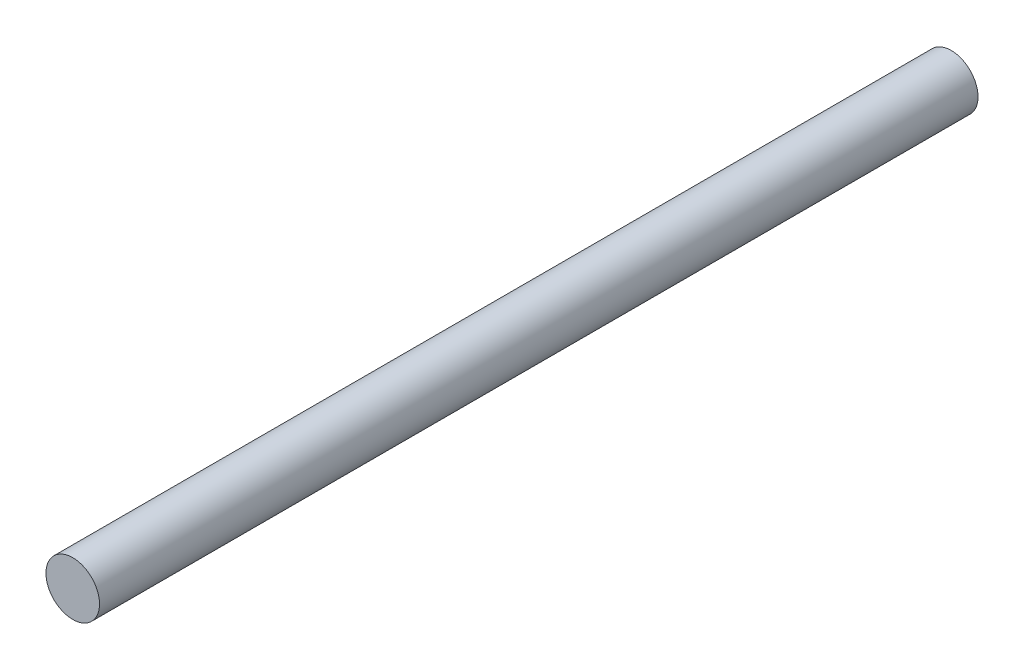
ISO-10303-21;
HEADER;
FILE_DESCRIPTION(('STEP AP214'),'2;1');
FILE_NAME('part.step','',(''),(''),'','','');
FILE_SCHEMA(('AUTOMOTIVE_DESIGN { 1 0 10303 214 1 1 1 1 }'));
ENDSEC;
DATA;
#1=APPLICATION_CONTEXT('core data for automotive mechanical design processes');
#2=APPLICATION_PROTOCOL_DEFINITION('international standard','automotive_design',2000,#1);
#3=PRODUCT_CONTEXT('',#1,'mechanical');
#4=PRODUCT('Part','Part','',(#3));
#5=PRODUCT_RELATED_PRODUCT_CATEGORY('part','',(#4));
#6=PRODUCT_DEFINITION_FORMATION('','',#4);
#7=PRODUCT_DEFINITION_CONTEXT('part definition',#1,'design');
#8=PRODUCT_DEFINITION('design','',#6,#7);
#9=PRODUCT_DEFINITION_SHAPE('','',#8);
#10=(LENGTH_UNIT() NAMED_UNIT(*) SI_UNIT(.MILLI.,.METRE.));
#11=(NAMED_UNIT(*) PLANE_ANGLE_UNIT() SI_UNIT($,.RADIAN.));
#12=(NAMED_UNIT(*) SI_UNIT($,.STERADIAN.) SOLID_ANGLE_UNIT());
#13=UNCERTAINTY_MEASURE_WITH_UNIT(LENGTH_MEASURE(1.E-05),#10,'distance_accuracy_value','');
#14=(GEOMETRIC_REPRESENTATION_CONTEXT(3) GLOBAL_UNCERTAINTY_ASSIGNED_CONTEXT((#13)) GLOBAL_UNIT_ASSIGNED_CONTEXT((#10,
#11,#12)) REPRESENTATION_CONTEXT('',''));
#15=CARTESIAN_POINT('',(0.,0.,0.));
#16=DIRECTION('',(0.,0.,1.));
#17=DIRECTION('',(1.,0.,0.));
#18=AXIS2_PLACEMENT_3D('',#15,#16,#17);
#19=CARTESIAN_POINT('',(0.,0.,65.0875));
#20=DIRECTION('',(0.,0.,-1.));
#21=DIRECTION('',(-1.,0.,0.));
#22=AXIS2_PLACEMENT_3D('',#19,#20,#21);
#23=CYLINDRICAL_SURFACE('',#22,3.96875);
#24=CARTESIAN_POINT('',(0.,0.,65.0875));
#25=DIRECTION('',(0.,0.,1.));
#26=DIRECTION('',(1.,0.,0.));
#27=AXIS2_PLACEMENT_3D('',#24,#25,#26);
#28=CIRCLE('',#27,3.96875);
#29=CARTESIAN_POINT('',(3.96875,0.,65.0875));
#30=VERTEX_POINT('',#29);
#31=EDGE_CURVE('E10',#30,#30,#28,.T.);
#32=ORIENTED_EDGE('',*,*,#31,.F.);
#33=EDGE_LOOP('',(#32));
#34=FACE_BOUND('',#33,.T.);
#35=CARTESIAN_POINT('',(0.,0.,-65.0875));
#36=DIRECTION('',(0.,0.,1.));
#37=DIRECTION('',(1.,0.,0.));
#38=AXIS2_PLACEMENT_3D('',#35,#36,#37);
#39=CIRCLE('',#38,3.96875);
#40=CARTESIAN_POINT('',(3.96875,0.,-65.0875));
#41=VERTEX_POINT('',#40);
#42=EDGE_CURVE('E33',#41,#41,#39,.T.);
#43=ORIENTED_EDGE('',*,*,#42,.T.);
#44=EDGE_LOOP('',(#43));
#45=FACE_BOUND('',#44,.T.);
#46=ADVANCED_FACE('F30',(#34,#45),#23,.T.);
#47=CARTESIAN_POINT('',(0.,0.,65.0875));
#48=DIRECTION('',(0.,0.,1.));
#49=DIRECTION('',(1.,0.,0.));
#50=AXIS2_PLACEMENT_3D('',#47,#48,#49);
#51=PLANE('',#50);
#52=ORIENTED_EDGE('',*,*,#31,.T.);
#53=EDGE_LOOP('',(#52));
#54=FACE_BOUND('',#53,.T.);
#55=ADVANCED_FACE('F45',(#54),#51,.T.);
#56=CARTESIAN_POINT('',(0.,0.,-65.0875));
#57=DIRECTION('',(0.,0.,1.));
#58=DIRECTION('',(1.,0.,0.));
#59=AXIS2_PLACEMENT_3D('',#56,#57,#58);
#60=PLANE('',#59);
#61=ORIENTED_EDGE('',*,*,#42,.F.);
#62=EDGE_LOOP('',(#61));
#63=FACE_BOUND('',#62,.T.);
#64=ADVANCED_FACE('F43',(#63),#60,.F.);
#65=CLOSED_SHELL('',(#46,#55,#64));
#66=MANIFOLD_SOLID_BREP('B2',#65);
#67=ADVANCED_BREP_SHAPE_REPRESENTATION('',(#18,#66),#14);
#68=SHAPE_DEFINITION_REPRESENTATION(#9,#67);
ENDSEC;
END-ISO-10303-21;
